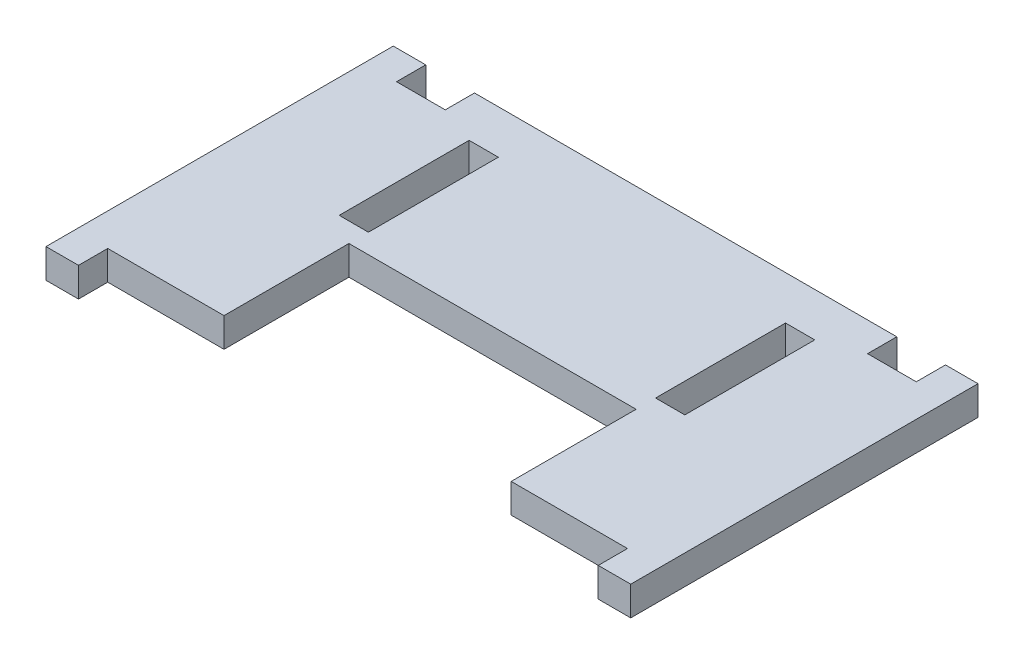
ISO-10303-21;
HEADER;
FILE_DESCRIPTION(('STEP AP214'),'2;1');
FILE_NAME('part.step','',(''),(''),'','','');
FILE_SCHEMA(('AUTOMOTIVE_DESIGN { 1 0 10303 214 1 1 1 1 }'));
ENDSEC;
DATA;
#1=APPLICATION_CONTEXT('core data for automotive mechanical design processes');
#2=APPLICATION_PROTOCOL_DEFINITION('international standard','automotive_design',2000,#1);
#3=PRODUCT_CONTEXT('',#1,'mechanical');
#4=PRODUCT('Part','Part','',(#3));
#5=PRODUCT_RELATED_PRODUCT_CATEGORY('part','',(#4));
#6=PRODUCT_DEFINITION_FORMATION('','',#4);
#7=PRODUCT_DEFINITION_CONTEXT('part definition',#1,'design');
#8=PRODUCT_DEFINITION('design','',#6,#7);
#9=PRODUCT_DEFINITION_SHAPE('','',#8);
#10=(LENGTH_UNIT() NAMED_UNIT(*) SI_UNIT(.MILLI.,.METRE.));
#11=(NAMED_UNIT(*) PLANE_ANGLE_UNIT() SI_UNIT($,.RADIAN.));
#12=(NAMED_UNIT(*) SI_UNIT($,.STERADIAN.) SOLID_ANGLE_UNIT());
#13=UNCERTAINTY_MEASURE_WITH_UNIT(LENGTH_MEASURE(1.E-05),#10,'distance_accuracy_value','');
#14=(GEOMETRIC_REPRESENTATION_CONTEXT(3) GLOBAL_UNCERTAINTY_ASSIGNED_CONTEXT((#13)) GLOBAL_UNIT_ASSIGNED_CONTEXT((#10,
#11,#12)) REPRESENTATION_CONTEXT('',''));
#15=CARTESIAN_POINT('',(0.,0.,0.));
#16=DIRECTION('',(0.,0.,1.));
#17=DIRECTION('',(1.,0.,0.));
#18=AXIS2_PLACEMENT_3D('',#15,#16,#17);
#19=CARTESIAN_POINT('',(-40.,4.5,-22.225));
#20=DIRECTION('',(0.,0.,1.));
#21=DIRECTION('',(1.,0.,0.));
#22=AXIS2_PLACEMENT_3D('',#19,#20,#21);
#23=PLANE('',#22);
#24=DIRECTION('',(-1.,0.,0.));
#25=VECTOR('',#24,1.);
#26=CARTESIAN_POINT('',(-40.,4.5,-22.225));
#27=LINE('',#26,#25);
#28=CARTESIAN_POINT('',(-32.5,4.5,-22.225));
#29=VERTEX_POINT('',#28);
#30=CARTESIAN_POINT('',(-40.,4.5,-22.225));
#31=VERTEX_POINT('',#30);
#32=EDGE_CURVE('E46',#29,#31,#27,.T.);
#33=ORIENTED_EDGE('',*,*,#32,.F.);
#34=DIRECTION('',(0.,1.,0.));
#35=VECTOR('',#34,1.);
#36=CARTESIAN_POINT('',(-32.5,-65.1555830301594,-22.225));
#37=LINE('',#36,#35);
#38=CARTESIAN_POINT('',(-32.5,0.,-22.225));
#39=VERTEX_POINT('',#38);
#40=EDGE_CURVE('E243',#39,#29,#37,.T.);
#41=ORIENTED_EDGE('',*,*,#40,.F.);
#42=DIRECTION('',(-1.,0.,0.));
#43=VECTOR('',#42,1.);
#44=CARTESIAN_POINT('',(-40.,0.,-22.225));
#45=LINE('',#44,#43);
#46=CARTESIAN_POINT('',(-40.,0.,-22.225));
#47=VERTEX_POINT('',#46);
#48=EDGE_CURVE('E384',#39,#47,#45,.T.);
#49=ORIENTED_EDGE('',*,*,#48,.T.);
#50=DIRECTION('',(0.,-1.,0.));
#51=VECTOR('',#50,1.);
#52=CARTESIAN_POINT('',(-40.,4.5,-22.225));
#53=LINE('',#52,#51);
#54=EDGE_CURVE('E11',#31,#47,#53,.T.);
#55=ORIENTED_EDGE('',*,*,#54,.F.);
#56=EDGE_LOOP('',(#33,#41,#49,#55));
#57=FACE_BOUND('',#56,.T.);
#58=ADVANCED_FACE('F31',(#57),#23,.F.);
#59=CARTESIAN_POINT('',(-40.,4.5,22.225));
#60=DIRECTION('',(0.,0.,-1.));
#61=DIRECTION('',(-1.,0.,0.));
#62=AXIS2_PLACEMENT_3D('',#59,#60,#61);
#63=PLANE('',#62);
#64=DIRECTION('',(1.,0.,0.));
#65=VECTOR('',#64,1.);
#66=CARTESIAN_POINT('',(-40.,0.,22.225));
#67=LINE('',#66,#65);
#68=CARTESIAN_POINT('',(-40.,0.,22.225));
#69=VERTEX_POINT('',#68);
#70=CARTESIAN_POINT('',(-22.1,0.,22.225));
#71=VERTEX_POINT('',#70);
#72=EDGE_CURVE('E414',#69,#71,#67,.T.);
#73=ORIENTED_EDGE('',*,*,#72,.T.);
#74=DIRECTION('',(0.,1.,0.));
#75=VECTOR('',#74,1.);
#76=CARTESIAN_POINT('',(-22.1,0.,22.225));
#77=LINE('',#76,#75);
#78=CARTESIAN_POINT('',(-22.1,4.5,22.225));
#79=VERTEX_POINT('',#78);
#80=EDGE_CURVE('E260',#71,#79,#77,.T.);
#81=ORIENTED_EDGE('',*,*,#80,.T.);
#82=DIRECTION('',(1.,0.,0.));
#83=VECTOR('',#82,1.);
#84=CARTESIAN_POINT('',(-40.,4.5,22.225));
#85=LINE('',#84,#83);
#86=CARTESIAN_POINT('',(-40.,4.5,22.225));
#87=VERTEX_POINT('',#86);
#88=EDGE_CURVE('E397',#87,#79,#85,.T.);
#89=ORIENTED_EDGE('',*,*,#88,.F.);
#90=DIRECTION('',(0.,-1.,0.));
#91=VECTOR('',#90,1.);
#92=CARTESIAN_POINT('',(-40.,4.5,22.225));
#93=LINE('',#92,#91);
#94=EDGE_CURVE('E400',#87,#69,#93,.T.);
#95=ORIENTED_EDGE('',*,*,#94,.T.);
#96=EDGE_LOOP('',(#73,#81,#89,#95));
#97=FACE_BOUND('',#96,.T.);
#98=ADVANCED_FACE('F498',(#97),#63,.F.);
#99=CARTESIAN_POINT('',(0.,4.5,22.225));
#100=DIRECTION('',(0.,1.,0.));
#101=DIRECTION('',(0.,0.,1.));
#102=AXIS2_PLACEMENT_3D('',#99,#100,#101);
#103=PLANE('',#102);
#104=DIRECTION('',(0.,0.,1.));
#105=VECTOR('',#104,1.);
#106=CARTESIAN_POINT('',(-22.1,4.5,22.225));
#107=LINE('',#106,#105);
#108=CARTESIAN_POINT('',(-22.1,4.5,3.));
#109=VERTEX_POINT('',#108);
#110=EDGE_CURVE('E261',#109,#79,#107,.T.);
#111=ORIENTED_EDGE('',*,*,#110,.F.);
#112=DIRECTION('',(-1.,0.,0.));
#113=VECTOR('',#112,1.);
#114=CARTESIAN_POINT('',(-22.1,4.5,3.));
#115=LINE('',#114,#113);
#116=CARTESIAN_POINT('',(22.1,4.5,3.));
#117=VERTEX_POINT('',#116);
#118=EDGE_CURVE('E254',#117,#109,#115,.T.);
#119=ORIENTED_EDGE('',*,*,#118,.F.);
#120=DIRECTION('',(0.,0.,-1.));
#121=VECTOR('',#120,1.);
#122=CARTESIAN_POINT('',(22.1,4.5,22.225));
#123=LINE('',#122,#121);
#124=CARTESIAN_POINT('',(22.1,4.5,22.225));
#125=VERTEX_POINT('',#124);
#126=EDGE_CURVE('E263',#125,#117,#123,.T.);
#127=ORIENTED_EDGE('',*,*,#126,.F.);
#128=CARTESIAN_POINT('',(40.,4.5,22.225));
#129=VERTEX_POINT('',#128);
#130=EDGE_CURVE('E396',#125,#129,#85,.T.);
#131=ORIENTED_EDGE('',*,*,#130,.T.);
#132=DIRECTION('',(0.,0.,-1.));
#133=VECTOR('',#132,1.);
#134=CARTESIAN_POINT('',(40.,4.5,22.225));
#135=LINE('',#134,#133);
#136=CARTESIAN_POINT('',(40.,4.5,26.725));
#137=VERTEX_POINT('',#136);
#138=EDGE_CURVE('E310',#137,#129,#135,.T.);
#139=ORIENTED_EDGE('',*,*,#138,.F.);
#140=DIRECTION('',(-1.,0.,0.));
#141=VECTOR('',#140,1.);
#142=CARTESIAN_POINT('',(40.,4.5,26.725));
#143=LINE('',#142,#141);
#144=CARTESIAN_POINT('',(45.,4.5,26.725));
#145=VERTEX_POINT('',#144);
#146=EDGE_CURVE('E313',#145,#137,#143,.T.);
#147=ORIENTED_EDGE('',*,*,#146,.F.);
#148=DIRECTION('',(0.,0.,1.));
#149=VECTOR('',#148,1.);
#150=CARTESIAN_POINT('',(45.,4.5,-26.725));
#151=LINE('',#150,#149);
#152=CARTESIAN_POINT('',(45.,4.5,-26.725));
#153=VERTEX_POINT('',#152);
#154=EDGE_CURVE('E317',#153,#145,#151,.T.);
#155=ORIENTED_EDGE('',*,*,#154,.F.);
#156=DIRECTION('',(1.,0.,0.));
#157=VECTOR('',#156,1.);
#158=CARTESIAN_POINT('',(40.,4.5,-26.725));
#159=LINE('',#158,#157);
#160=CARTESIAN_POINT('',(40.,4.5,-26.725));
#161=VERTEX_POINT('',#160);
#162=EDGE_CURVE('E320',#161,#153,#159,.T.);
#163=ORIENTED_EDGE('',*,*,#162,.F.);
#164=DIRECTION('',(0.,0.,-1.));
#165=VECTOR('',#164,1.);
#166=CARTESIAN_POINT('',(40.,4.5,-22.225));
#167=LINE('',#166,#165);
#168=CARTESIAN_POINT('',(40.,4.5,-22.225));
#169=VERTEX_POINT('',#168);
#170=EDGE_CURVE('E323',#169,#161,#167,.T.);
#171=ORIENTED_EDGE('',*,*,#170,.F.);
#172=CARTESIAN_POINT('',(32.5,4.5,-22.225));
#173=VERTEX_POINT('',#172);
#174=EDGE_CURVE('E237',#169,#173,#27,.T.);
#175=ORIENTED_EDGE('',*,*,#174,.T.);
#176=DIRECTION('',(0.,0.,-1.));
#177=VECTOR('',#176,1.);
#178=CARTESIAN_POINT('',(32.5,4.5,-22.225));
#179=LINE('',#178,#177);
#180=CARTESIAN_POINT('',(32.5,4.5,-26.725));
#181=VERTEX_POINT('',#180);
#182=EDGE_CURVE('E221',#173,#181,#179,.T.);
#183=ORIENTED_EDGE('',*,*,#182,.T.);
#184=DIRECTION('',(-1.,0.,0.));
#185=VECTOR('',#184,1.);
#186=CARTESIAN_POINT('',(-32.5,4.5,-26.725));
#187=LINE('',#186,#185);
#188=CARTESIAN_POINT('',(-32.5,4.5,-26.725));
#189=VERTEX_POINT('',#188);
#190=EDGE_CURVE('E235',#181,#189,#187,.T.);
#191=ORIENTED_EDGE('',*,*,#190,.T.);
#192=DIRECTION('',(0.,0.,1.));
#193=VECTOR('',#192,1.);
#194=CARTESIAN_POINT('',(-32.5,4.5,-22.225));
#195=LINE('',#194,#193);
#196=EDGE_CURVE('E238',#189,#29,#195,.T.);
#197=ORIENTED_EDGE('',*,*,#196,.T.);
#198=ORIENTED_EDGE('',*,*,#32,.T.);
#199=DIRECTION('',(0.,0.,-1.));
#200=VECTOR('',#199,1.);
#201=CARTESIAN_POINT('',(-40.,4.5,-22.225));
#202=LINE('',#201,#200);
#203=CARTESIAN_POINT('',(-40.,4.5,-26.725));
#204=VERTEX_POINT('',#203);
#205=EDGE_CURVE('E386',#31,#204,#202,.T.);
#206=ORIENTED_EDGE('',*,*,#205,.T.);
#207=DIRECTION('',(-1.,0.,0.));
#208=VECTOR('',#207,1.);
#209=CARTESIAN_POINT('',(-40.,4.5,-26.725));
#210=LINE('',#209,#208);
#211=CARTESIAN_POINT('',(-45.,4.5,-26.725));
#212=VERTEX_POINT('',#211);
#213=EDGE_CURVE('E388',#204,#212,#210,.T.);
#214=ORIENTED_EDGE('',*,*,#213,.T.);
#215=DIRECTION('',(0.,0.,1.));
#216=VECTOR('',#215,1.);
#217=CARTESIAN_POINT('',(-45.,4.5,-26.725));
#218=LINE('',#217,#216);
#219=CARTESIAN_POINT('',(-45.,4.5,26.725));
#220=VERTEX_POINT('',#219);
#221=EDGE_CURVE('E390',#212,#220,#218,.T.);
#222=ORIENTED_EDGE('',*,*,#221,.T.);
#223=DIRECTION('',(1.,0.,0.));
#224=VECTOR('',#223,1.);
#225=CARTESIAN_POINT('',(-40.,4.5,26.725));
#226=LINE('',#225,#224);
#227=CARTESIAN_POINT('',(-40.,4.5,26.725));
#228=VERTEX_POINT('',#227);
#229=EDGE_CURVE('E392',#220,#228,#226,.T.);
#230=ORIENTED_EDGE('',*,*,#229,.T.);
#231=DIRECTION('',(0.,0.,-1.));
#232=VECTOR('',#231,1.);
#233=CARTESIAN_POINT('',(-40.,4.5,22.225));
#234=LINE('',#233,#232);
#235=EDGE_CURVE('E394',#228,#87,#234,.T.);
#236=ORIENTED_EDGE('',*,*,#235,.T.);
#237=ORIENTED_EDGE('',*,*,#88,.T.);
#238=EDGE_LOOP('',(#111,#119,#127,#131,#139,#147,#155,#163,#171,#175,#183,#191,#197,#198,#206,
#214,#222,#230,#236,#237));
#239=FACE_BOUND('',#238,.T.);
#240=DIRECTION('',(1.,0.,0.));
#241=VECTOR('',#240,1.);
#242=CARTESIAN_POINT('',(-26.6,4.5,0.));
#243=LINE('',#242,#241);
#244=CARTESIAN_POINT('',(-26.6,4.5,0.));
#245=VERTEX_POINT('',#244);
#246=CARTESIAN_POINT('',(-22.1,4.5,0.));
#247=VERTEX_POINT('',#246);
#248=EDGE_CURVE('E356',#245,#247,#243,.T.);
#249=ORIENTED_EDGE('',*,*,#248,.F.);
#250=DIRECTION('',(0.,0.,1.));
#251=VECTOR('',#250,1.);
#252=CARTESIAN_POINT('',(-26.6,4.5,-20.));
#253=LINE('',#252,#251);
#254=CARTESIAN_POINT('',(-26.6,4.5,-20.));
#255=VERTEX_POINT('',#254);
#256=EDGE_CURVE('E354',#255,#245,#253,.T.);
#257=ORIENTED_EDGE('',*,*,#256,.F.);
#258=DIRECTION('',(-1.,0.,0.));
#259=VECTOR('',#258,1.);
#260=CARTESIAN_POINT('',(-26.6,4.5,-20.));
#261=LINE('',#260,#259);
#262=CARTESIAN_POINT('',(-22.1,4.5,-20.));
#263=VERTEX_POINT('',#262);
#264=EDGE_CURVE('E362',#263,#255,#261,.T.);
#265=ORIENTED_EDGE('',*,*,#264,.F.);
#266=DIRECTION('',(0.,0.,-1.));
#267=VECTOR('',#266,1.);
#268=CARTESIAN_POINT('',(-22.1,4.5,-20.));
#269=LINE('',#268,#267);
#270=EDGE_CURVE('E359',#247,#263,#269,.T.);
#271=ORIENTED_EDGE('',*,*,#270,.F.);
#272=EDGE_LOOP('',(#249,#257,#265,#271));
#273=FACE_BOUND('',#272,.T.);
#274=DIRECTION('',(0.,0.,1.));
#275=VECTOR('',#274,1.);
#276=CARTESIAN_POINT('',(26.6,4.5,-20.));
#277=LINE('',#276,#275);
#278=CARTESIAN_POINT('',(26.6,4.5,-20.));
#279=VERTEX_POINT('',#278);
#280=CARTESIAN_POINT('',(26.6,4.5,0.));
#281=VERTEX_POINT('',#280);
#282=EDGE_CURVE('E278',#279,#281,#277,.T.);
#283=ORIENTED_EDGE('',*,*,#282,.T.);
#284=DIRECTION('',(-1.,0.,0.));
#285=VECTOR('',#284,1.);
#286=CARTESIAN_POINT('',(26.6,4.5,0.));
#287=LINE('',#286,#285);
#288=CARTESIAN_POINT('',(22.1,4.5,0.));
#289=VERTEX_POINT('',#288);
#290=EDGE_CURVE('E288',#281,#289,#287,.T.);
#291=ORIENTED_EDGE('',*,*,#290,.T.);
#292=DIRECTION('',(0.,0.,-1.));
#293=VECTOR('',#292,1.);
#294=CARTESIAN_POINT('',(22.1,4.5,-20.));
#295=LINE('',#294,#293);
#296=CARTESIAN_POINT('',(22.1,4.5,-20.));
#297=VERTEX_POINT('',#296);
#298=EDGE_CURVE('E285',#289,#297,#295,.T.);
#299=ORIENTED_EDGE('',*,*,#298,.T.);
#300=DIRECTION('',(1.,0.,0.));
#301=VECTOR('',#300,1.);
#302=CARTESIAN_POINT('',(26.6,4.5,-20.));
#303=LINE('',#302,#301);
#304=EDGE_CURVE('E281',#297,#279,#303,.T.);
#305=ORIENTED_EDGE('',*,*,#304,.T.);
#306=EDGE_LOOP('',(#283,#291,#299,#305));
#307=FACE_BOUND('',#306,.T.);
#308=ADVANCED_FACE('F232',(#239,#273,#307),#103,.T.);
#309=CARTESIAN_POINT('',(0.,0.,22.225));
#310=DIRECTION('',(0.,1.,0.));
#311=DIRECTION('',(0.,0.,1.));
#312=AXIS2_PLACEMENT_3D('',#309,#310,#311);
#313=PLANE('',#312);
#314=DIRECTION('',(-1.,0.,0.));
#315=VECTOR('',#314,1.);
#316=CARTESIAN_POINT('',(-22.1,0.,3.));
#317=LINE('',#316,#315);
#318=CARTESIAN_POINT('',(22.1,0.,3.));
#319=VERTEX_POINT('',#318);
#320=CARTESIAN_POINT('',(-22.1,0.,3.));
#321=VERTEX_POINT('',#320);
#322=EDGE_CURVE('E257',#319,#321,#317,.T.);
#323=ORIENTED_EDGE('',*,*,#322,.T.);
#324=DIRECTION('',(0.,0.,1.));
#325=VECTOR('',#324,1.);
#326=CARTESIAN_POINT('',(-22.1,0.,22.225));
#327=LINE('',#326,#325);
#328=EDGE_CURVE('E250',#321,#71,#327,.T.);
#329=ORIENTED_EDGE('',*,*,#328,.T.);
#330=ORIENTED_EDGE('',*,*,#72,.F.);
#331=DIRECTION('',(0.,0.,-1.));
#332=VECTOR('',#331,1.);
#333=CARTESIAN_POINT('',(-40.,0.,22.225));
#334=LINE('',#333,#332);
#335=CARTESIAN_POINT('',(-40.,0.,26.725));
#336=VERTEX_POINT('',#335);
#337=EDGE_CURVE('E411',#336,#69,#334,.T.);
#338=ORIENTED_EDGE('',*,*,#337,.F.);
#339=DIRECTION('',(1.,0.,0.));
#340=VECTOR('',#339,1.);
#341=CARTESIAN_POINT('',(-40.,0.,26.725));
#342=LINE('',#341,#340);
#343=CARTESIAN_POINT('',(-45.,0.,26.725));
#344=VERTEX_POINT('',#343);
#345=EDGE_CURVE('E409',#344,#336,#342,.T.);
#346=ORIENTED_EDGE('',*,*,#345,.F.);
#347=DIRECTION('',(0.,0.,1.));
#348=VECTOR('',#347,1.);
#349=CARTESIAN_POINT('',(-45.,0.,-26.725));
#350=LINE('',#349,#348);
#351=CARTESIAN_POINT('',(-45.,0.,-26.725));
#352=VERTEX_POINT('',#351);
#353=EDGE_CURVE('E407',#352,#344,#350,.T.);
#354=ORIENTED_EDGE('',*,*,#353,.F.);
#355=DIRECTION('',(-1.,0.,0.));
#356=VECTOR('',#355,1.);
#357=CARTESIAN_POINT('',(-40.,0.,-26.725));
#358=LINE('',#357,#356);
#359=CARTESIAN_POINT('',(-40.,0.,-26.725));
#360=VERTEX_POINT('',#359);
#361=EDGE_CURVE('E405',#360,#352,#358,.T.);
#362=ORIENTED_EDGE('',*,*,#361,.F.);
#363=DIRECTION('',(0.,0.,-1.));
#364=VECTOR('',#363,1.);
#365=CARTESIAN_POINT('',(-40.,0.,-22.225));
#366=LINE('',#365,#364);
#367=EDGE_CURVE('E403',#47,#360,#366,.T.);
#368=ORIENTED_EDGE('',*,*,#367,.F.);
#369=ORIENTED_EDGE('',*,*,#48,.F.);
#370=DIRECTION('',(0.,0.,-1.));
#371=VECTOR('',#370,1.);
#372=CARTESIAN_POINT('',(-32.5,0.,-22.225));
#373=LINE('',#372,#371);
#374=CARTESIAN_POINT('',(-32.5,0.,-26.725));
#375=VERTEX_POINT('',#374);
#376=EDGE_CURVE('E264',#39,#375,#373,.T.);
#377=ORIENTED_EDGE('',*,*,#376,.T.);
#378=DIRECTION('',(1.,0.,0.));
#379=VECTOR('',#378,1.);
#380=CARTESIAN_POINT('',(-32.5,0.,-26.725));
#381=LINE('',#380,#379);
#382=CARTESIAN_POINT('',(32.5,0.,-26.725));
#383=VERTEX_POINT('',#382);
#384=EDGE_CURVE('E455',#375,#383,#381,.T.);
#385=ORIENTED_EDGE('',*,*,#384,.T.);
#386=DIRECTION('',(0.,0.,1.));
#387=VECTOR('',#386,1.);
#388=CARTESIAN_POINT('',(32.5,0.,-22.225));
#389=LINE('',#388,#387);
#390=CARTESIAN_POINT('',(32.5,0.,-22.225));
#391=VERTEX_POINT('',#390);
#392=EDGE_CURVE('E223',#383,#391,#389,.T.);
#393=ORIENTED_EDGE('',*,*,#392,.T.);
#394=CARTESIAN_POINT('',(40.,0.,-22.225));
#395=VERTEX_POINT('',#394);
#396=EDGE_CURVE('E401',#395,#391,#45,.T.);
#397=ORIENTED_EDGE('',*,*,#396,.F.);
#398=DIRECTION('',(0.,0.,-1.));
#399=VECTOR('',#398,1.);
#400=CARTESIAN_POINT('',(40.,0.,-22.225));
#401=LINE('',#400,#399);
#402=CARTESIAN_POINT('',(40.,0.,-26.725));
#403=VERTEX_POINT('',#402);
#404=EDGE_CURVE('E314',#395,#403,#401,.T.);
#405=ORIENTED_EDGE('',*,*,#404,.T.);
#406=DIRECTION('',(1.,0.,0.));
#407=VECTOR('',#406,1.);
#408=CARTESIAN_POINT('',(40.,0.,-26.725));
#409=LINE('',#408,#407);
#410=CARTESIAN_POINT('',(45.,0.,-26.725));
#411=VERTEX_POINT('',#410);
#412=EDGE_CURVE('E335',#403,#411,#409,.T.);
#413=ORIENTED_EDGE('',*,*,#412,.T.);
#414=DIRECTION('',(0.,0.,1.));
#415=VECTOR('',#414,1.);
#416=CARTESIAN_POINT('',(45.,0.,-26.725));
#417=LINE('',#416,#415);
#418=CARTESIAN_POINT('',(45.,0.,26.725));
#419=VERTEX_POINT('',#418);
#420=EDGE_CURVE('E332',#411,#419,#417,.T.);
#421=ORIENTED_EDGE('',*,*,#420,.T.);
#422=DIRECTION('',(-1.,0.,0.));
#423=VECTOR('',#422,1.);
#424=CARTESIAN_POINT('',(40.,0.,26.725));
#425=LINE('',#424,#423);
#426=CARTESIAN_POINT('',(40.,0.,26.725));
#427=VERTEX_POINT('',#426);
#428=EDGE_CURVE('E329',#419,#427,#425,.T.);
#429=ORIENTED_EDGE('',*,*,#428,.T.);
#430=DIRECTION('',(0.,0.,-1.));
#431=VECTOR('',#430,1.);
#432=CARTESIAN_POINT('',(40.,0.,22.225));
#433=LINE('',#432,#431);
#434=CARTESIAN_POINT('',(40.,0.,22.225));
#435=VERTEX_POINT('',#434);
#436=EDGE_CURVE('E309',#427,#435,#433,.T.);
#437=ORIENTED_EDGE('',*,*,#436,.T.);
#438=CARTESIAN_POINT('',(22.1,0.,22.225));
#439=VERTEX_POINT('',#438);
#440=EDGE_CURVE('E413',#439,#435,#67,.T.);
#441=ORIENTED_EDGE('',*,*,#440,.F.);
#442=DIRECTION('',(0.,0.,-1.));
#443=VECTOR('',#442,1.);
#444=CARTESIAN_POINT('',(22.1,0.,22.225));
#445=LINE('',#444,#443);
#446=EDGE_CURVE('E253',#439,#319,#445,.T.);
#447=ORIENTED_EDGE('',*,*,#446,.T.);
#448=EDGE_LOOP('',(#323,#329,#330,#338,#346,#354,#362,#368,#369,#377,#385,#393,#397,#405,#413,
#421,#429,#437,#441,#447));
#449=FACE_BOUND('',#448,.T.);
#450=DIRECTION('',(0.,0.,1.));
#451=VECTOR('',#450,1.);
#452=CARTESIAN_POINT('',(-26.6,0.,-20.));
#453=LINE('',#452,#451);
#454=CARTESIAN_POINT('',(-26.6,0.,-20.));
#455=VERTEX_POINT('',#454);
#456=CARTESIAN_POINT('',(-26.6,0.,0.));
#457=VERTEX_POINT('',#456);
#458=EDGE_CURVE('E353',#455,#457,#453,.T.);
#459=ORIENTED_EDGE('',*,*,#458,.T.);
#460=DIRECTION('',(1.,0.,0.));
#461=VECTOR('',#460,1.);
#462=CARTESIAN_POINT('',(-26.6,0.,0.));
#463=LINE('',#462,#461);
#464=CARTESIAN_POINT('',(-22.1,0.,0.));
#465=VERTEX_POINT('',#464);
#466=EDGE_CURVE('E367',#457,#465,#463,.T.);
#467=ORIENTED_EDGE('',*,*,#466,.T.);
#468=DIRECTION('',(0.,0.,-1.));
#469=VECTOR('',#468,1.);
#470=CARTESIAN_POINT('',(-22.1,0.,-20.));
#471=LINE('',#470,#469);
#472=CARTESIAN_POINT('',(-22.1,0.,-20.));
#473=VERTEX_POINT('',#472);
#474=EDGE_CURVE('E370',#465,#473,#471,.T.);
#475=ORIENTED_EDGE('',*,*,#474,.T.);
#476=DIRECTION('',(-1.,0.,0.));
#477=VECTOR('',#476,1.);
#478=CARTESIAN_POINT('',(-26.6,0.,-20.));
#479=LINE('',#478,#477);
#480=EDGE_CURVE('E357',#473,#455,#479,.T.);
#481=ORIENTED_EDGE('',*,*,#480,.T.);
#482=EDGE_LOOP('',(#459,#467,#475,#481));
#483=FACE_BOUND('',#482,.T.);
#484=DIRECTION('',(-1.,0.,0.));
#485=VECTOR('',#484,1.);
#486=CARTESIAN_POINT('',(26.6,0.,0.));
#487=LINE('',#486,#485);
#488=CARTESIAN_POINT('',(26.6,0.,0.));
#489=VERTEX_POINT('',#488);
#490=CARTESIAN_POINT('',(22.1,0.,0.));
#491=VERTEX_POINT('',#490);
#492=EDGE_CURVE('E282',#489,#491,#487,.T.);
#493=ORIENTED_EDGE('',*,*,#492,.F.);
#494=DIRECTION('',(0.,0.,1.));
#495=VECTOR('',#494,1.);
#496=CARTESIAN_POINT('',(26.6,0.,-20.));
#497=LINE('',#496,#495);
#498=CARTESIAN_POINT('',(26.6,0.,-20.));
#499=VERTEX_POINT('',#498);
#500=EDGE_CURVE('E271',#499,#489,#497,.T.);
#501=ORIENTED_EDGE('',*,*,#500,.F.);
#502=DIRECTION('',(1.,0.,0.));
#503=VECTOR('',#502,1.);
#504=CARTESIAN_POINT('',(26.6,0.,-20.));
#505=LINE('',#504,#503);
#506=CARTESIAN_POINT('',(22.1,0.,-20.));
#507=VERTEX_POINT('',#506);
#508=EDGE_CURVE('E293',#507,#499,#505,.T.);
#509=ORIENTED_EDGE('',*,*,#508,.F.);
#510=DIRECTION('',(0.,0.,-1.));
#511=VECTOR('',#510,1.);
#512=CARTESIAN_POINT('',(22.1,0.,-20.));
#513=LINE('',#512,#511);
#514=EDGE_CURVE('E296',#491,#507,#513,.T.);
#515=ORIENTED_EDGE('',*,*,#514,.F.);
#516=EDGE_LOOP('',(#493,#501,#509,#515));
#517=FACE_BOUND('',#516,.T.);
#518=ADVANCED_FACE('F439',(#449,#483,#517),#313,.F.);
#519=ORIENTED_EDGE('',*,*,#396,.T.);
#520=DIRECTION('',(0.,1.,0.));
#521=VECTOR('',#520,1.);
#522=CARTESIAN_POINT('',(32.5,-65.1555830301594,-22.225));
#523=LINE('',#522,#521);
#524=EDGE_CURVE('E54',#391,#173,#523,.T.);
#525=ORIENTED_EDGE('',*,*,#524,.T.);
#526=ORIENTED_EDGE('',*,*,#174,.F.);
#527=DIRECTION('',(0.,-1.,0.));
#528=VECTOR('',#527,1.);
#529=CARTESIAN_POINT('',(40.,4.5,-22.225));
#530=LINE('',#529,#528);
#531=EDGE_CURVE('E326',#169,#395,#530,.T.);
#532=ORIENTED_EDGE('',*,*,#531,.T.);
#533=EDGE_LOOP('',(#519,#525,#526,#532));
#534=FACE_BOUND('',#533,.T.);
#535=ADVANCED_FACE('F33',(#534),#23,.F.);
#536=CARTESIAN_POINT('',(-40.,4.5,-22.225));
#537=DIRECTION('',(-1.,0.,0.));
#538=DIRECTION('',(0.,0.,1.));
#539=AXIS2_PLACEMENT_3D('',#536,#537,#538);
#540=PLANE('',#539);
#541=ORIENTED_EDGE('',*,*,#367,.T.);
#542=DIRECTION('',(0.,-1.,0.));
#543=VECTOR('',#542,1.);
#544=CARTESIAN_POINT('',(-40.,4.5,-26.725));
#545=LINE('',#544,#543);
#546=EDGE_CURVE('E39',#204,#360,#545,.T.);
#547=ORIENTED_EDGE('',*,*,#546,.F.);
#548=ORIENTED_EDGE('',*,*,#205,.F.);
#549=ORIENTED_EDGE('',*,*,#54,.T.);
#550=EDGE_LOOP('',(#541,#547,#548,#549));
#551=FACE_BOUND('',#550,.T.);
#552=ADVANCED_FACE('F453',(#551),#540,.F.);
#553=CARTESIAN_POINT('',(-40.,4.5,-26.725));
#554=DIRECTION('',(0.,0.,1.));
#555=DIRECTION('',(1.,0.,0.));
#556=AXIS2_PLACEMENT_3D('',#553,#554,#555);
#557=PLANE('',#556);
#558=ORIENTED_EDGE('',*,*,#361,.T.);
#559=DIRECTION('',(0.,-1.,0.));
#560=VECTOR('',#559,1.);
#561=CARTESIAN_POINT('',(-45.,4.5,-26.725));
#562=LINE('',#561,#560);
#563=EDGE_CURVE('E425',#212,#352,#562,.T.);
#564=ORIENTED_EDGE('',*,*,#563,.F.);
#565=ORIENTED_EDGE('',*,*,#213,.F.);
#566=ORIENTED_EDGE('',*,*,#546,.T.);
#567=EDGE_LOOP('',(#558,#564,#565,#566));
#568=FACE_BOUND('',#567,.T.);
#569=ADVANCED_FACE('F432',(#568),#557,.F.);
#570=CARTESIAN_POINT('',(-45.,4.5,-26.725));
#571=DIRECTION('',(1.,0.,0.));
#572=DIRECTION('',(0.,0.,-1.));
#573=AXIS2_PLACEMENT_3D('',#570,#571,#572);
#574=PLANE('',#573);
#575=ORIENTED_EDGE('',*,*,#353,.T.);
#576=DIRECTION('',(0.,-1.,0.));
#577=VECTOR('',#576,1.);
#578=CARTESIAN_POINT('',(-45.,4.5,26.725));
#579=LINE('',#578,#577);
#580=EDGE_CURVE('E422',#220,#344,#579,.T.);
#581=ORIENTED_EDGE('',*,*,#580,.F.);
#582=ORIENTED_EDGE('',*,*,#221,.F.);
#583=ORIENTED_EDGE('',*,*,#563,.T.);
#584=EDGE_LOOP('',(#575,#581,#582,#583));
#585=FACE_BOUND('',#584,.T.);
#586=ADVANCED_FACE('F445',(#585),#574,.F.);
#587=CARTESIAN_POINT('',(-40.,4.5,26.725));
#588=DIRECTION('',(0.,0.,-1.));
#589=DIRECTION('',(-1.,0.,0.));
#590=AXIS2_PLACEMENT_3D('',#587,#588,#589);
#591=PLANE('',#590);
#592=ORIENTED_EDGE('',*,*,#345,.T.);
#593=DIRECTION('',(0.,-1.,0.));
#594=VECTOR('',#593,1.);
#595=CARTESIAN_POINT('',(-40.,4.5,26.725));
#596=LINE('',#595,#594);
#597=EDGE_CURVE('E419',#228,#336,#596,.T.);
#598=ORIENTED_EDGE('',*,*,#597,.F.);
#599=ORIENTED_EDGE('',*,*,#229,.F.);
#600=ORIENTED_EDGE('',*,*,#580,.T.);
#601=EDGE_LOOP('',(#592,#598,#599,#600));
#602=FACE_BOUND('',#601,.T.);
#603=ADVANCED_FACE('F449',(#602),#591,.F.);
#604=CARTESIAN_POINT('',(-40.,4.5,22.225));
#605=DIRECTION('',(-1.,0.,0.));
#606=DIRECTION('',(0.,0.,1.));
#607=AXIS2_PLACEMENT_3D('',#604,#605,#606);
#608=PLANE('',#607);
#609=ORIENTED_EDGE('',*,*,#337,.T.);
#610=ORIENTED_EDGE('',*,*,#94,.F.);
#611=ORIENTED_EDGE('',*,*,#235,.F.);
#612=ORIENTED_EDGE('',*,*,#597,.T.);
#613=EDGE_LOOP('',(#609,#610,#611,#612));
#614=FACE_BOUND('',#613,.T.);
#615=ADVANCED_FACE('F501',(#614),#608,.F.);
#616=ORIENTED_EDGE('',*,*,#130,.F.);
#617=DIRECTION('',(0.,1.,0.));
#618=VECTOR('',#617,1.);
#619=CARTESIAN_POINT('',(22.1,0.,22.225));
#620=LINE('',#619,#618);
#621=EDGE_CURVE('E274',#439,#125,#620,.T.);
#622=ORIENTED_EDGE('',*,*,#621,.F.);
#623=ORIENTED_EDGE('',*,*,#440,.T.);
#624=DIRECTION('',(0.,-1.,0.));
#625=VECTOR('',#624,1.);
#626=CARTESIAN_POINT('',(40.,4.5,22.225));
#627=LINE('',#626,#625);
#628=EDGE_CURVE('E350',#129,#435,#627,.T.);
#629=ORIENTED_EDGE('',*,*,#628,.F.);
#630=EDGE_LOOP('',(#616,#622,#623,#629));
#631=FACE_BOUND('',#630,.T.);
#632=ADVANCED_FACE('F486',(#631),#63,.F.);
#633=CARTESIAN_POINT('',(-26.6,4.5,-20.));
#634=DIRECTION('',(1.,0.,0.));
#635=DIRECTION('',(0.,0.,-1.));
#636=AXIS2_PLACEMENT_3D('',#633,#634,#635);
#637=PLANE('',#636);
#638=ORIENTED_EDGE('',*,*,#458,.F.);
#639=DIRECTION('',(0.,-1.,0.));
#640=VECTOR('',#639,1.);
#641=CARTESIAN_POINT('',(-26.6,4.5,-20.));
#642=LINE('',#641,#640);
#643=EDGE_CURVE('E364',#255,#455,#642,.T.);
#644=ORIENTED_EDGE('',*,*,#643,.F.);
#645=ORIENTED_EDGE('',*,*,#256,.T.);
#646=DIRECTION('',(0.,-1.,0.));
#647=VECTOR('',#646,1.);
#648=CARTESIAN_POINT('',(-26.6,4.5,0.));
#649=LINE('',#648,#647);
#650=EDGE_CURVE('E381',#245,#457,#649,.T.);
#651=ORIENTED_EDGE('',*,*,#650,.T.);
#652=EDGE_LOOP('',(#638,#644,#645,#651));
#653=FACE_BOUND('',#652,.T.);
#654=ADVANCED_FACE('F508',(#653),#637,.T.);
#655=CARTESIAN_POINT('',(-26.6,4.5,0.));
#656=DIRECTION('',(0.,0.,-1.));
#657=DIRECTION('',(-1.,0.,0.));
#658=AXIS2_PLACEMENT_3D('',#655,#656,#657);
#659=PLANE('',#658);
#660=ORIENTED_EDGE('',*,*,#466,.F.);
#661=ORIENTED_EDGE('',*,*,#650,.F.);
#662=ORIENTED_EDGE('',*,*,#248,.T.);
#663=DIRECTION('',(0.,-1.,0.));
#664=VECTOR('',#663,1.);
#665=CARTESIAN_POINT('',(-22.1,4.5,0.));
#666=LINE('',#665,#664);
#667=EDGE_CURVE('E379',#247,#465,#666,.T.);
#668=ORIENTED_EDGE('',*,*,#667,.T.);
#669=EDGE_LOOP('',(#660,#661,#662,#668));
#670=FACE_BOUND('',#669,.T.);
#671=ADVANCED_FACE('F528',(#670),#659,.T.);
#672=CARTESIAN_POINT('',(-22.1,4.5,-20.));
#673=DIRECTION('',(-1.,0.,0.));
#674=DIRECTION('',(0.,0.,1.));
#675=AXIS2_PLACEMENT_3D('',#672,#673,#674);
#676=PLANE('',#675);
#677=ORIENTED_EDGE('',*,*,#474,.F.);
#678=ORIENTED_EDGE('',*,*,#667,.F.);
#679=ORIENTED_EDGE('',*,*,#270,.T.);
#680=DIRECTION('',(0.,-1.,0.));
#681=VECTOR('',#680,1.);
#682=CARTESIAN_POINT('',(-22.1,4.5,-20.));
#683=LINE('',#682,#681);
#684=EDGE_CURVE('E377',#263,#473,#683,.T.);
#685=ORIENTED_EDGE('',*,*,#684,.T.);
#686=EDGE_LOOP('',(#677,#678,#679,#685));
#687=FACE_BOUND('',#686,.T.);
#688=ADVANCED_FACE('F532',(#687),#676,.T.);
#689=CARTESIAN_POINT('',(-26.6,4.5,-20.));
#690=DIRECTION('',(0.,0.,1.));
#691=DIRECTION('',(1.,0.,0.));
#692=AXIS2_PLACEMENT_3D('',#689,#690,#691);
#693=PLANE('',#692);
#694=ORIENTED_EDGE('',*,*,#480,.F.);
#695=ORIENTED_EDGE('',*,*,#684,.F.);
#696=ORIENTED_EDGE('',*,*,#264,.T.);
#697=ORIENTED_EDGE('',*,*,#643,.T.);
#698=EDGE_LOOP('',(#694,#695,#696,#697));
#699=FACE_BOUND('',#698,.T.);
#700=ADVANCED_FACE('F536',(#699),#693,.T.);
#701=CARTESIAN_POINT('',(40.,4.5,22.225));
#702=DIRECTION('',(-1.,0.,0.));
#703=DIRECTION('',(0.,0.,1.));
#704=AXIS2_PLACEMENT_3D('',#701,#702,#703);
#705=PLANE('',#704);
#706=ORIENTED_EDGE('',*,*,#436,.F.);
#707=DIRECTION('',(0.,-1.,0.));
#708=VECTOR('',#707,1.);
#709=CARTESIAN_POINT('',(40.,4.5,26.725));
#710=LINE('',#709,#708);
#711=EDGE_CURVE('E348',#137,#427,#710,.T.);
#712=ORIENTED_EDGE('',*,*,#711,.F.);
#713=ORIENTED_EDGE('',*,*,#138,.T.);
#714=ORIENTED_EDGE('',*,*,#628,.T.);
#715=EDGE_LOOP('',(#706,#712,#713,#714));
#716=FACE_BOUND('',#715,.T.);
#717=ADVANCED_FACE('F480',(#716),#705,.T.);
#718=CARTESIAN_POINT('',(40.,4.5,26.725));
#719=DIRECTION('',(0.,0.,1.));
#720=DIRECTION('',(1.,0.,0.));
#721=AXIS2_PLACEMENT_3D('',#718,#719,#720);
#722=PLANE('',#721);
#723=ORIENTED_EDGE('',*,*,#428,.F.);
#724=DIRECTION('',(0.,-1.,0.));
#725=VECTOR('',#724,1.);
#726=CARTESIAN_POINT('',(45.,4.5,26.725));
#727=LINE('',#726,#725);
#728=EDGE_CURVE('E346',#145,#419,#727,.T.);
#729=ORIENTED_EDGE('',*,*,#728,.F.);
#730=ORIENTED_EDGE('',*,*,#146,.T.);
#731=ORIENTED_EDGE('',*,*,#711,.T.);
#732=EDGE_LOOP('',(#723,#729,#730,#731));
#733=FACE_BOUND('',#732,.T.);
#734=ADVANCED_FACE('F476',(#733),#722,.T.);
#735=CARTESIAN_POINT('',(45.,4.5,-26.725));
#736=DIRECTION('',(1.,0.,0.));
#737=DIRECTION('',(0.,0.,-1.));
#738=AXIS2_PLACEMENT_3D('',#735,#736,#737);
#739=PLANE('',#738);
#740=ORIENTED_EDGE('',*,*,#420,.F.);
#741=DIRECTION('',(0.,-1.,0.));
#742=VECTOR('',#741,1.);
#743=CARTESIAN_POINT('',(45.,4.5,-26.725));
#744=LINE('',#743,#742);
#745=EDGE_CURVE('E344',#153,#411,#744,.T.);
#746=ORIENTED_EDGE('',*,*,#745,.F.);
#747=ORIENTED_EDGE('',*,*,#154,.T.);
#748=ORIENTED_EDGE('',*,*,#728,.T.);
#749=EDGE_LOOP('',(#740,#746,#747,#748));
#750=FACE_BOUND('',#749,.T.);
#751=ADVANCED_FACE('F472',(#750),#739,.T.);
#752=CARTESIAN_POINT('',(40.,4.5,-26.725));
#753=DIRECTION('',(0.,0.,-1.));
#754=DIRECTION('',(-1.,0.,0.));
#755=AXIS2_PLACEMENT_3D('',#752,#753,#754);
#756=PLANE('',#755);
#757=ORIENTED_EDGE('',*,*,#412,.F.);
#758=DIRECTION('',(0.,-1.,0.));
#759=VECTOR('',#758,1.);
#760=CARTESIAN_POINT('',(40.,4.5,-26.725));
#761=LINE('',#760,#759);
#762=EDGE_CURVE('E342',#161,#403,#761,.T.);
#763=ORIENTED_EDGE('',*,*,#762,.F.);
#764=ORIENTED_EDGE('',*,*,#162,.T.);
#765=ORIENTED_EDGE('',*,*,#745,.T.);
#766=EDGE_LOOP('',(#757,#763,#764,#765));
#767=FACE_BOUND('',#766,.T.);
#768=ADVANCED_FACE('F468',(#767),#756,.T.);
#769=CARTESIAN_POINT('',(40.,4.5,-22.225));
#770=DIRECTION('',(-1.,0.,0.));
#771=DIRECTION('',(0.,0.,1.));
#772=AXIS2_PLACEMENT_3D('',#769,#770,#771);
#773=PLANE('',#772);
#774=ORIENTED_EDGE('',*,*,#404,.F.);
#775=ORIENTED_EDGE('',*,*,#531,.F.);
#776=ORIENTED_EDGE('',*,*,#170,.T.);
#777=ORIENTED_EDGE('',*,*,#762,.T.);
#778=EDGE_LOOP('',(#774,#775,#776,#777));
#779=FACE_BOUND('',#778,.T.);
#780=ADVANCED_FACE('F464',(#779),#773,.T.);
#781=CARTESIAN_POINT('',(26.6,4.5,-20.));
#782=DIRECTION('',(1.,0.,0.));
#783=DIRECTION('',(0.,0.,-1.));
#784=AXIS2_PLACEMENT_3D('',#781,#782,#783);
#785=PLANE('',#784);
#786=ORIENTED_EDGE('',*,*,#500,.T.);
#787=DIRECTION('',(0.,-1.,0.));
#788=VECTOR('',#787,1.);
#789=CARTESIAN_POINT('',(26.6,4.5,0.));
#790=LINE('',#789,#788);
#791=EDGE_CURVE('E291',#281,#489,#790,.T.);
#792=ORIENTED_EDGE('',*,*,#791,.F.);
#793=ORIENTED_EDGE('',*,*,#282,.F.);
#794=DIRECTION('',(0.,-1.,0.));
#795=VECTOR('',#794,1.);
#796=CARTESIAN_POINT('',(26.6,4.5,-20.));
#797=LINE('',#796,#795);
#798=EDGE_CURVE('E307',#279,#499,#797,.T.);
#799=ORIENTED_EDGE('',*,*,#798,.T.);
#800=EDGE_LOOP('',(#786,#792,#793,#799));
#801=FACE_BOUND('',#800,.T.);
#802=ADVANCED_FACE('F551',(#801),#785,.F.);
#803=CARTESIAN_POINT('',(26.6,4.5,-20.));
#804=DIRECTION('',(0.,0.,-1.));
#805=DIRECTION('',(-1.,0.,0.));
#806=AXIS2_PLACEMENT_3D('',#803,#804,#805);
#807=PLANE('',#806);
#808=ORIENTED_EDGE('',*,*,#508,.T.);
#809=ORIENTED_EDGE('',*,*,#798,.F.);
#810=ORIENTED_EDGE('',*,*,#304,.F.);
#811=DIRECTION('',(0.,-1.,0.));
#812=VECTOR('',#811,1.);
#813=CARTESIAN_POINT('',(22.1,4.5,-20.));
#814=LINE('',#813,#812);
#815=EDGE_CURVE('E305',#297,#507,#814,.T.);
#816=ORIENTED_EDGE('',*,*,#815,.T.);
#817=EDGE_LOOP('',(#808,#809,#810,#816));
#818=FACE_BOUND('',#817,.T.);
#819=ADVANCED_FACE('F554',(#818),#807,.F.);
#820=CARTESIAN_POINT('',(22.1,4.5,-20.));
#821=DIRECTION('',(-1.,0.,0.));
#822=DIRECTION('',(0.,0.,1.));
#823=AXIS2_PLACEMENT_3D('',#820,#821,#822);
#824=PLANE('',#823);
#825=ORIENTED_EDGE('',*,*,#514,.T.);
#826=ORIENTED_EDGE('',*,*,#815,.F.);
#827=ORIENTED_EDGE('',*,*,#298,.F.);
#828=DIRECTION('',(0.,-1.,0.));
#829=VECTOR('',#828,1.);
#830=CARTESIAN_POINT('',(22.1,4.5,0.));
#831=LINE('',#830,#829);
#832=EDGE_CURVE('E303',#289,#491,#831,.T.);
#833=ORIENTED_EDGE('',*,*,#832,.T.);
#834=EDGE_LOOP('',(#825,#826,#827,#833));
#835=FACE_BOUND('',#834,.T.);
#836=ADVANCED_FACE('F558',(#835),#824,.F.);
#837=CARTESIAN_POINT('',(26.6,4.5,0.));
#838=DIRECTION('',(0.,0.,1.));
#839=DIRECTION('',(1.,0.,0.));
#840=AXIS2_PLACEMENT_3D('',#837,#838,#839);
#841=PLANE('',#840);
#842=ORIENTED_EDGE('',*,*,#492,.T.);
#843=ORIENTED_EDGE('',*,*,#832,.F.);
#844=ORIENTED_EDGE('',*,*,#290,.F.);
#845=ORIENTED_EDGE('',*,*,#791,.T.);
#846=EDGE_LOOP('',(#842,#843,#844,#845));
#847=FACE_BOUND('',#846,.T.);
#848=ADVANCED_FACE('F562',(#847),#841,.F.);
#849=CARTESIAN_POINT('',(-22.1,0.,22.225));
#850=DIRECTION('',(-1.,0.,0.));
#851=DIRECTION('',(0.,0.,1.));
#852=AXIS2_PLACEMENT_3D('',#849,#850,#851);
#853=PLANE('',#852);
#854=ORIENTED_EDGE('',*,*,#110,.T.);
#855=ORIENTED_EDGE('',*,*,#80,.F.);
#856=ORIENTED_EDGE('',*,*,#328,.F.);
#857=DIRECTION('',(0.,1.,0.));
#858=VECTOR('',#857,1.);
#859=CARTESIAN_POINT('',(-22.1,0.,3.));
#860=LINE('',#859,#858);
#861=EDGE_CURVE('E269',#321,#109,#860,.T.);
#862=ORIENTED_EDGE('',*,*,#861,.T.);
#863=EDGE_LOOP('',(#854,#855,#856,#862));
#864=FACE_BOUND('',#863,.T.);
#865=ADVANCED_FACE('F566',(#864),#853,.F.);
#866=CARTESIAN_POINT('',(-22.1,0.,3.));
#867=DIRECTION('',(0.,0.,-1.));
#868=DIRECTION('',(-1.,0.,0.));
#869=AXIS2_PLACEMENT_3D('',#866,#867,#868);
#870=PLANE('',#869);
#871=ORIENTED_EDGE('',*,*,#118,.T.);
#872=ORIENTED_EDGE('',*,*,#861,.F.);
#873=ORIENTED_EDGE('',*,*,#322,.F.);
#874=DIRECTION('',(0.,1.,0.));
#875=VECTOR('',#874,1.);
#876=CARTESIAN_POINT('',(22.1,0.,3.));
#877=LINE('',#876,#875);
#878=EDGE_CURVE('E272',#319,#117,#877,.T.);
#879=ORIENTED_EDGE('',*,*,#878,.T.);
#880=EDGE_LOOP('',(#871,#872,#873,#879));
#881=FACE_BOUND('',#880,.T.);
#882=ADVANCED_FACE('F492',(#881),#870,.F.);
#883=CARTESIAN_POINT('',(22.1,0.,22.225));
#884=DIRECTION('',(1.,0.,0.));
#885=DIRECTION('',(0.,0.,-1.));
#886=AXIS2_PLACEMENT_3D('',#883,#884,#885);
#887=PLANE('',#886);
#888=ORIENTED_EDGE('',*,*,#126,.T.);
#889=ORIENTED_EDGE('',*,*,#878,.F.);
#890=ORIENTED_EDGE('',*,*,#446,.F.);
#891=ORIENTED_EDGE('',*,*,#621,.T.);
#892=EDGE_LOOP('',(#888,#889,#890,#891));
#893=FACE_BOUND('',#892,.T.);
#894=ADVANCED_FACE('F489',(#893),#887,.F.);
#895=CARTESIAN_POINT('',(-32.5,-65.1555830301594,-22.225));
#896=DIRECTION('',(-1.,0.,0.));
#897=DIRECTION('',(0.,0.,1.));
#898=AXIS2_PLACEMENT_3D('',#895,#896,#897);
#899=PLANE('',#898);
#900=ORIENTED_EDGE('',*,*,#376,.F.);
#901=ORIENTED_EDGE('',*,*,#40,.T.);
#902=ORIENTED_EDGE('',*,*,#196,.F.);
#903=DIRECTION('',(0.,1.,0.));
#904=VECTOR('',#903,1.);
#905=CARTESIAN_POINT('',(-32.5,-65.1555830301594,-26.725));
#906=LINE('',#905,#904);
#907=EDGE_CURVE('E227',#375,#189,#906,.T.);
#908=ORIENTED_EDGE('',*,*,#907,.F.);
#909=EDGE_LOOP('',(#900,#901,#902,#908));
#910=FACE_BOUND('',#909,.T.);
#911=ADVANCED_FACE('F459',(#910),#899,.T.);
#912=CARTESIAN_POINT('',(-32.5,-65.1555830301594,-26.725));
#913=DIRECTION('',(0.,0.,-1.));
#914=DIRECTION('',(-1.,0.,0.));
#915=AXIS2_PLACEMENT_3D('',#912,#913,#914);
#916=PLANE('',#915);
#917=ORIENTED_EDGE('',*,*,#384,.F.);
#918=ORIENTED_EDGE('',*,*,#907,.T.);
#919=ORIENTED_EDGE('',*,*,#190,.F.);
#920=DIRECTION('',(0.,1.,0.));
#921=VECTOR('',#920,1.);
#922=CARTESIAN_POINT('',(32.5,-65.1555830301594,-26.725));
#923=LINE('',#922,#921);
#924=EDGE_CURVE('E218',#383,#181,#923,.T.);
#925=ORIENTED_EDGE('',*,*,#924,.F.);
#926=EDGE_LOOP('',(#917,#918,#919,#925));
#927=FACE_BOUND('',#926,.T.);
#928=ADVANCED_FACE('F240',(#927),#916,.T.);
#929=CARTESIAN_POINT('',(32.5,-65.1555830301594,-22.225));
#930=DIRECTION('',(1.,0.,0.));
#931=DIRECTION('',(0.,0.,-1.));
#932=AXIS2_PLACEMENT_3D('',#929,#930,#931);
#933=PLANE('',#932);
#934=ORIENTED_EDGE('',*,*,#392,.F.);
#935=ORIENTED_EDGE('',*,*,#924,.T.);
#936=ORIENTED_EDGE('',*,*,#182,.F.);
#937=ORIENTED_EDGE('',*,*,#524,.F.);
#938=EDGE_LOOP('',(#934,#935,#936,#937));
#939=FACE_BOUND('',#938,.T.);
#940=ADVANCED_FACE('F220',(#939),#933,.T.);
#941=CLOSED_SHELL('',(#58,#98,#308,#518,#535,#552,#569,#586,#603,#615,#632,#654,#671,#688,#700,
#717,#734,#751,#768,#780,#802,#819,#836,#848,#865,#882,#894,#911,#928,#940));
#942=MANIFOLD_SOLID_BREP('B2',#941);
#943=ADVANCED_BREP_SHAPE_REPRESENTATION('',(#18,#942),#14);
#944=SHAPE_DEFINITION_REPRESENTATION(#9,#943);
ENDSEC;
END-ISO-10303-21;
